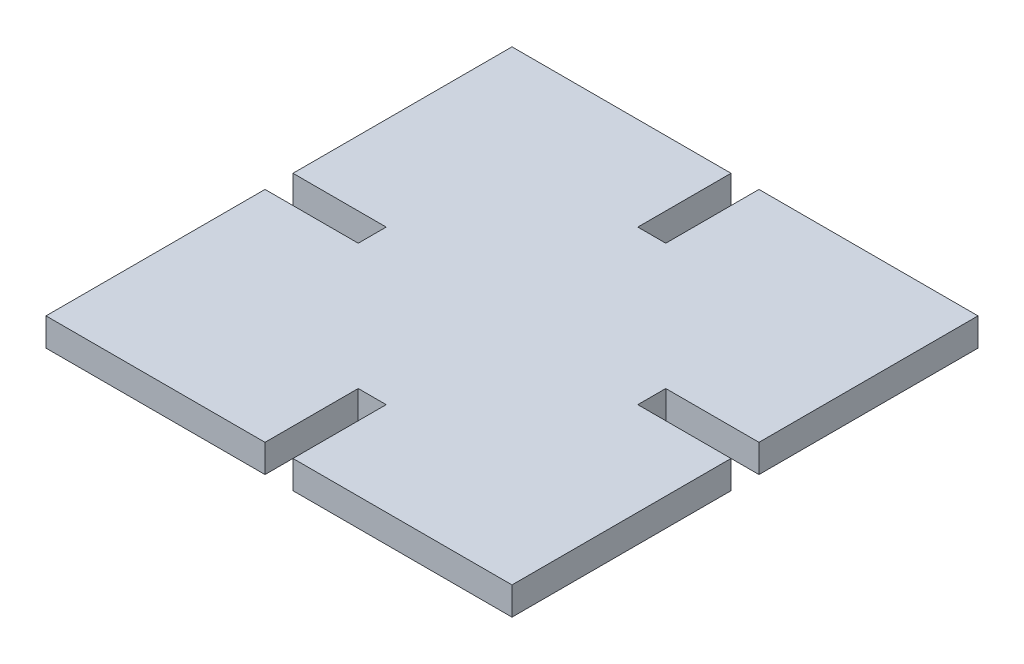
ISO-10303-21;
HEADER;
FILE_DESCRIPTION(('STEP AP214'),'2;1');
FILE_NAME('part.step','',(''),(''),'','','');
FILE_SCHEMA(('AUTOMOTIVE_DESIGN { 1 0 10303 214 1 1 1 1 }'));
ENDSEC;
DATA;
#1=APPLICATION_CONTEXT('core data for automotive mechanical design processes');
#2=APPLICATION_PROTOCOL_DEFINITION('international standard','automotive_design',2000,#1);
#3=PRODUCT_CONTEXT('',#1,'mechanical');
#4=PRODUCT('Part','Part','',(#3));
#5=PRODUCT_RELATED_PRODUCT_CATEGORY('part','',(#4));
#6=PRODUCT_DEFINITION_FORMATION('','',#4);
#7=PRODUCT_DEFINITION_CONTEXT('part definition',#1,'design');
#8=PRODUCT_DEFINITION('design','',#6,#7);
#9=PRODUCT_DEFINITION_SHAPE('','',#8);
#10=(LENGTH_UNIT() NAMED_UNIT(*) SI_UNIT(.MILLI.,.METRE.));
#11=(NAMED_UNIT(*) PLANE_ANGLE_UNIT() SI_UNIT($,.RADIAN.));
#12=(NAMED_UNIT(*) SI_UNIT($,.STERADIAN.) SOLID_ANGLE_UNIT());
#13=UNCERTAINTY_MEASURE_WITH_UNIT(LENGTH_MEASURE(1.E-05),#10,'distance_accuracy_value','');
#14=(GEOMETRIC_REPRESENTATION_CONTEXT(3) GLOBAL_UNCERTAINTY_ASSIGNED_CONTEXT((#13)) GLOBAL_UNIT_ASSIGNED_CONTEXT((#10,
#11,#12)) REPRESENTATION_CONTEXT('',''));
#15=CARTESIAN_POINT('',(0.,0.,0.));
#16=DIRECTION('',(0.,0.,1.));
#17=DIRECTION('',(1.,0.,0.));
#18=AXIS2_PLACEMENT_3D('',#15,#16,#17);
#19=CARTESIAN_POINT('',(-1.5,3.,-15.));
#20=DIRECTION('',(0.,0.,-1.));
#21=DIRECTION('',(-1.,0.,0.));
#22=AXIS2_PLACEMENT_3D('',#19,#20,#21);
#23=PLANE('',#22);
#24=DIRECTION('',(1.,0.,0.));
#25=VECTOR('',#24,1.);
#26=CARTESIAN_POINT('',(-1.5,0.,-15.));
#27=LINE('',#26,#25);
#28=CARTESIAN_POINT('',(-1.5,0.,-15.));
#29=VERTEX_POINT('',#28);
#30=CARTESIAN_POINT('',(1.5,0.,-15.));
#31=VERTEX_POINT('',#30);
#32=EDGE_CURVE('E198',#29,#31,#27,.T.);
#33=ORIENTED_EDGE('',*,*,#32,.F.);
#34=DIRECTION('',(0.,-1.,0.));
#35=VECTOR('',#34,1.);
#36=CARTESIAN_POINT('',(-1.5,3.,-15.));
#37=LINE('',#36,#35);
#38=CARTESIAN_POINT('',(-1.5,3.,-15.));
#39=VERTEX_POINT('',#38);
#40=EDGE_CURVE('E11',#39,#29,#37,.T.);
#41=ORIENTED_EDGE('',*,*,#40,.F.);
#42=DIRECTION('',(1.,0.,0.));
#43=VECTOR('',#42,1.);
#44=CARTESIAN_POINT('',(-1.5,3.,-15.));
#45=LINE('',#44,#43);
#46=CARTESIAN_POINT('',(1.5,3.,-15.));
#47=VERTEX_POINT('',#46);
#48=EDGE_CURVE('E246',#39,#47,#45,.T.);
#49=ORIENTED_EDGE('',*,*,#48,.T.);
#50=DIRECTION('',(0.,-1.,0.));
#51=VECTOR('',#50,1.);
#52=CARTESIAN_POINT('',(1.5,3.,-15.));
#53=LINE('',#52,#51);
#54=EDGE_CURVE('E35',#47,#31,#53,.T.);
#55=ORIENTED_EDGE('',*,*,#54,.T.);
#56=EDGE_LOOP('',(#33,#41,#49,#55));
#57=FACE_BOUND('',#56,.T.);
#58=ADVANCED_FACE('F32',(#57),#23,.T.);
#59=CARTESIAN_POINT('',(-1.5,3.,-25.));
#60=DIRECTION('',(1.,0.,0.));
#61=DIRECTION('',(0.,0.,-1.));
#62=AXIS2_PLACEMENT_3D('',#59,#60,#61);
#63=PLANE('',#62);
#64=DIRECTION('',(0.,0.,1.));
#65=VECTOR('',#64,1.);
#66=CARTESIAN_POINT('',(-1.5,0.,-25.));
#67=LINE('',#66,#65);
#68=CARTESIAN_POINT('',(-1.5,0.,-25.));
#69=VERTEX_POINT('',#68);
#70=EDGE_CURVE('E244',#69,#29,#67,.T.);
#71=ORIENTED_EDGE('',*,*,#70,.F.);
#72=DIRECTION('',(0.,-1.,0.));
#73=VECTOR('',#72,1.);
#74=CARTESIAN_POINT('',(-1.5,3.,-25.));
#75=LINE('',#74,#73);
#76=CARTESIAN_POINT('',(-1.5,3.,-25.));
#77=VERTEX_POINT('',#76);
#78=EDGE_CURVE('E41',#77,#69,#75,.T.);
#79=ORIENTED_EDGE('',*,*,#78,.F.);
#80=DIRECTION('',(0.,0.,1.));
#81=VECTOR('',#80,1.);
#82=CARTESIAN_POINT('',(-1.5,3.,-25.));
#83=LINE('',#82,#81);
#84=EDGE_CURVE('E193',#77,#39,#83,.T.);
#85=ORIENTED_EDGE('',*,*,#84,.T.);
#86=ORIENTED_EDGE('',*,*,#40,.T.);
#87=EDGE_LOOP('',(#71,#79,#85,#86));
#88=FACE_BOUND('',#87,.T.);
#89=ADVANCED_FACE('F290',(#88),#63,.T.);
#90=CARTESIAN_POINT('',(-25.,3.,-25.));
#91=DIRECTION('',(0.,0.,-1.));
#92=DIRECTION('',(-1.,0.,0.));
#93=AXIS2_PLACEMENT_3D('',#90,#91,#92);
#94=PLANE('',#93);
#95=DIRECTION('',(1.,0.,0.));
#96=VECTOR('',#95,1.);
#97=CARTESIAN_POINT('',(-25.,0.,-25.));
#98=LINE('',#97,#96);
#99=CARTESIAN_POINT('',(-25.,0.,-25.));
#100=VERTEX_POINT('',#99);
#101=EDGE_CURVE('E179',#100,#69,#98,.T.);
#102=ORIENTED_EDGE('',*,*,#101,.F.);
#103=DIRECTION('',(0.,-1.,0.));
#104=VECTOR('',#103,1.);
#105=CARTESIAN_POINT('',(-25.,3.,-25.));
#106=LINE('',#105,#104);
#107=CARTESIAN_POINT('',(-25.,3.,-25.));
#108=VERTEX_POINT('',#107);
#109=EDGE_CURVE('E173',#108,#100,#106,.T.);
#110=ORIENTED_EDGE('',*,*,#109,.F.);
#111=DIRECTION('',(1.,0.,0.));
#112=VECTOR('',#111,1.);
#113=CARTESIAN_POINT('',(-25.,3.,-25.));
#114=LINE('',#113,#112);
#115=EDGE_CURVE('E177',#108,#77,#114,.T.);
#116=ORIENTED_EDGE('',*,*,#115,.T.);
#117=ORIENTED_EDGE('',*,*,#78,.T.);
#118=EDGE_LOOP('',(#102,#110,#116,#117));
#119=FACE_BOUND('',#118,.T.);
#120=ADVANCED_FACE('F175',(#119),#94,.T.);
#121=CARTESIAN_POINT('',(-25.,3.,-25.));
#122=DIRECTION('',(1.,0.,0.));
#123=DIRECTION('',(0.,0.,-1.));
#124=AXIS2_PLACEMENT_3D('',#121,#122,#123);
#125=PLANE('',#124);
#126=DIRECTION('',(0.,0.,1.));
#127=VECTOR('',#126,1.);
#128=CARTESIAN_POINT('',(-25.,0.,-25.));
#129=LINE('',#128,#127);
#130=CARTESIAN_POINT('',(-25.,0.,-1.49999999999999));
#131=VERTEX_POINT('',#130);
#132=EDGE_CURVE('E241',#100,#131,#129,.T.);
#133=ORIENTED_EDGE('',*,*,#132,.T.);
#134=DIRECTION('',(0.,-1.,0.));
#135=VECTOR('',#134,1.);
#136=CARTESIAN_POINT('',(-25.,3.,-1.49999999999999));
#137=LINE('',#136,#135);
#138=CARTESIAN_POINT('',(-25.,3.,-1.49999999999999));
#139=VERTEX_POINT('',#138);
#140=EDGE_CURVE('E182',#139,#131,#137,.T.);
#141=ORIENTED_EDGE('',*,*,#140,.F.);
#142=DIRECTION('',(0.,0.,1.));
#143=VECTOR('',#142,1.);
#144=CARTESIAN_POINT('',(-25.,3.,-25.));
#145=LINE('',#144,#143);
#146=EDGE_CURVE('E185',#108,#139,#145,.T.);
#147=ORIENTED_EDGE('',*,*,#146,.F.);
#148=ORIENTED_EDGE('',*,*,#109,.T.);
#149=EDGE_LOOP('',(#133,#141,#147,#148));
#150=FACE_BOUND('',#149,.T.);
#151=ADVANCED_FACE('F186',(#150),#125,.F.);
#152=CARTESIAN_POINT('',(-25.,3.,-1.49999999999999));
#153=DIRECTION('',(0.,0.,-1.));
#154=DIRECTION('',(-1.,0.,0.));
#155=AXIS2_PLACEMENT_3D('',#152,#153,#154);
#156=PLANE('',#155);
#157=DIRECTION('',(1.,0.,0.));
#158=VECTOR('',#157,1.);
#159=CARTESIAN_POINT('',(-25.,0.,-1.49999999999999));
#160=LINE('',#159,#158);
#161=CARTESIAN_POINT('',(-15.,0.,-1.49999999999999));
#162=VERTEX_POINT('',#161);
#163=EDGE_CURVE('E239',#131,#162,#160,.T.);
#164=ORIENTED_EDGE('',*,*,#163,.T.);
#165=DIRECTION('',(0.,-1.,0.));
#166=VECTOR('',#165,1.);
#167=CARTESIAN_POINT('',(-15.,3.,-1.49999999999999));
#168=LINE('',#167,#166);
#169=CARTESIAN_POINT('',(-15.,3.,-1.49999999999999));
#170=VERTEX_POINT('',#169);
#171=EDGE_CURVE('E250',#170,#162,#168,.T.);
#172=ORIENTED_EDGE('',*,*,#171,.F.);
#173=DIRECTION('',(1.,0.,0.));
#174=VECTOR('',#173,1.);
#175=CARTESIAN_POINT('',(-25.,3.,-1.49999999999999));
#176=LINE('',#175,#174);
#177=EDGE_CURVE('E190',#139,#170,#176,.T.);
#178=ORIENTED_EDGE('',*,*,#177,.F.);
#179=ORIENTED_EDGE('',*,*,#140,.T.);
#180=EDGE_LOOP('',(#164,#172,#178,#179));
#181=FACE_BOUND('',#180,.T.);
#182=ADVANCED_FACE('F303',(#181),#156,.F.);
#183=CARTESIAN_POINT('',(-15.,3.,-1.49999999999999));
#184=DIRECTION('',(1.,0.,0.));
#185=DIRECTION('',(0.,0.,-1.));
#186=AXIS2_PLACEMENT_3D('',#183,#184,#185);
#187=PLANE('',#186);
#188=DIRECTION('',(0.,0.,1.));
#189=VECTOR('',#188,1.);
#190=CARTESIAN_POINT('',(-15.,0.,-1.49999999999999));
#191=LINE('',#190,#189);
#192=CARTESIAN_POINT('',(-15.,0.,1.49999999999999));
#193=VERTEX_POINT('',#192);
#194=EDGE_CURVE('E237',#162,#193,#191,.T.);
#195=ORIENTED_EDGE('',*,*,#194,.T.);
#196=DIRECTION('',(0.,-1.,0.));
#197=VECTOR('',#196,1.);
#198=CARTESIAN_POINT('',(-15.,3.,1.49999999999999));
#199=LINE('',#198,#197);
#200=CARTESIAN_POINT('',(-15.,3.,1.49999999999999));
#201=VERTEX_POINT('',#200);
#202=EDGE_CURVE('E253',#201,#193,#199,.T.);
#203=ORIENTED_EDGE('',*,*,#202,.F.);
#204=DIRECTION('',(0.,0.,1.));
#205=VECTOR('',#204,1.);
#206=CARTESIAN_POINT('',(-15.,3.,-1.49999999999999));
#207=LINE('',#206,#205);
#208=EDGE_CURVE('E548',#170,#201,#207,.T.);
#209=ORIENTED_EDGE('',*,*,#208,.F.);
#210=ORIENTED_EDGE('',*,*,#171,.T.);
#211=EDGE_LOOP('',(#195,#203,#209,#210));
#212=FACE_BOUND('',#211,.T.);
#213=ADVANCED_FACE('F306',(#212),#187,.F.);
#214=CARTESIAN_POINT('',(-15.,3.,1.49999999999999));
#215=DIRECTION('',(0.,0.,1.));
#216=DIRECTION('',(1.,0.,0.));
#217=AXIS2_PLACEMENT_3D('',#214,#215,#216);
#218=PLANE('',#217);
#219=DIRECTION('',(-1.,0.,0.));
#220=VECTOR('',#219,1.);
#221=CARTESIAN_POINT('',(-15.,0.,1.49999999999999));
#222=LINE('',#221,#220);
#223=CARTESIAN_POINT('',(-25.,0.,1.49999999999999));
#224=VERTEX_POINT('',#223);
#225=EDGE_CURVE('E235',#193,#224,#222,.T.);
#226=ORIENTED_EDGE('',*,*,#225,.T.);
#227=DIRECTION('',(0.,-1.,0.));
#228=VECTOR('',#227,1.);
#229=CARTESIAN_POINT('',(-25.,3.,1.49999999999999));
#230=LINE('',#229,#228);
#231=CARTESIAN_POINT('',(-25.,3.,1.49999999999999));
#232=VERTEX_POINT('',#231);
#233=EDGE_CURVE('E256',#232,#224,#230,.T.);
#234=ORIENTED_EDGE('',*,*,#233,.F.);
#235=DIRECTION('',(-1.,0.,0.));
#236=VECTOR('',#235,1.);
#237=CARTESIAN_POINT('',(-15.,3.,1.49999999999999));
#238=LINE('',#237,#236);
#239=EDGE_CURVE('E542',#201,#232,#238,.T.);
#240=ORIENTED_EDGE('',*,*,#239,.F.);
#241=ORIENTED_EDGE('',*,*,#202,.T.);
#242=EDGE_LOOP('',(#226,#234,#240,#241));
#243=FACE_BOUND('',#242,.T.);
#244=ADVANCED_FACE('F310',(#243),#218,.F.);
#245=CARTESIAN_POINT('',(-25.,3.,1.49999999999999));
#246=DIRECTION('',(1.,0.,0.));
#247=DIRECTION('',(0.,0.,-1.));
#248=AXIS2_PLACEMENT_3D('',#245,#246,#247);
#249=PLANE('',#248);
#250=DIRECTION('',(0.,0.,1.));
#251=VECTOR('',#250,1.);
#252=CARTESIAN_POINT('',(-25.,0.,1.49999999999999));
#253=LINE('',#252,#251);
#254=CARTESIAN_POINT('',(-25.,0.,25.));
#255=VERTEX_POINT('',#254);
#256=EDGE_CURVE('E233',#224,#255,#253,.T.);
#257=ORIENTED_EDGE('',*,*,#256,.T.);
#258=DIRECTION('',(0.,-1.,0.));
#259=VECTOR('',#258,1.);
#260=CARTESIAN_POINT('',(-25.,3.,25.));
#261=LINE('',#260,#259);
#262=CARTESIAN_POINT('',(-25.,3.,25.));
#263=VERTEX_POINT('',#262);
#264=EDGE_CURVE('E259',#263,#255,#261,.T.);
#265=ORIENTED_EDGE('',*,*,#264,.F.);
#266=DIRECTION('',(0.,0.,1.));
#267=VECTOR('',#266,1.);
#268=CARTESIAN_POINT('',(-25.,3.,1.49999999999999));
#269=LINE('',#268,#267);
#270=EDGE_CURVE('E539',#232,#263,#269,.T.);
#271=ORIENTED_EDGE('',*,*,#270,.F.);
#272=ORIENTED_EDGE('',*,*,#233,.T.);
#273=EDGE_LOOP('',(#257,#265,#271,#272));
#274=FACE_BOUND('',#273,.T.);
#275=ADVANCED_FACE('F314',(#274),#249,.F.);
#276=CARTESIAN_POINT('',(-25.,3.,25.));
#277=DIRECTION('',(0.,0.,-1.));
#278=DIRECTION('',(-1.,0.,0.));
#279=AXIS2_PLACEMENT_3D('',#276,#277,#278);
#280=PLANE('',#279);
#281=DIRECTION('',(1.,0.,0.));
#282=VECTOR('',#281,1.);
#283=CARTESIAN_POINT('',(-25.,0.,25.));
#284=LINE('',#283,#282);
#285=CARTESIAN_POINT('',(-1.5,0.,25.));
#286=VERTEX_POINT('',#285);
#287=EDGE_CURVE('E231',#255,#286,#284,.T.);
#288=ORIENTED_EDGE('',*,*,#287,.T.);
#289=DIRECTION('',(0.,-1.,0.));
#290=VECTOR('',#289,1.);
#291=CARTESIAN_POINT('',(-1.5,3.,25.));
#292=LINE('',#291,#290);
#293=CARTESIAN_POINT('',(-1.5,3.,25.));
#294=VERTEX_POINT('',#293);
#295=EDGE_CURVE('E262',#294,#286,#292,.T.);
#296=ORIENTED_EDGE('',*,*,#295,.F.);
#297=DIRECTION('',(1.,0.,0.));
#298=VECTOR('',#297,1.);
#299=CARTESIAN_POINT('',(-25.,3.,25.));
#300=LINE('',#299,#298);
#301=EDGE_CURVE('E537',#263,#294,#300,.T.);
#302=ORIENTED_EDGE('',*,*,#301,.F.);
#303=ORIENTED_EDGE('',*,*,#264,.T.);
#304=EDGE_LOOP('',(#288,#296,#302,#303));
#305=FACE_BOUND('',#304,.T.);
#306=ADVANCED_FACE('F318',(#305),#280,.F.);
#307=CARTESIAN_POINT('',(-1.5,3.,25.));
#308=DIRECTION('',(-1.,0.,0.));
#309=DIRECTION('',(0.,0.,1.));
#310=AXIS2_PLACEMENT_3D('',#307,#308,#309);
#311=PLANE('',#310);
#312=DIRECTION('',(0.,0.,-1.));
#313=VECTOR('',#312,1.);
#314=CARTESIAN_POINT('',(-1.5,0.,25.));
#315=LINE('',#314,#313);
#316=CARTESIAN_POINT('',(-1.5,0.,15.));
#317=VERTEX_POINT('',#316);
#318=EDGE_CURVE('E229',#286,#317,#315,.T.);
#319=ORIENTED_EDGE('',*,*,#318,.T.);
#320=DIRECTION('',(0.,-1.,0.));
#321=VECTOR('',#320,1.);
#322=CARTESIAN_POINT('',(-1.5,3.,15.));
#323=LINE('',#322,#321);
#324=CARTESIAN_POINT('',(-1.5,3.,15.));
#325=VERTEX_POINT('',#324);
#326=EDGE_CURVE('E265',#325,#317,#323,.T.);
#327=ORIENTED_EDGE('',*,*,#326,.F.);
#328=DIRECTION('',(0.,0.,-1.));
#329=VECTOR('',#328,1.);
#330=CARTESIAN_POINT('',(-1.5,3.,25.));
#331=LINE('',#330,#329);
#332=EDGE_CURVE('E530',#294,#325,#331,.T.);
#333=ORIENTED_EDGE('',*,*,#332,.F.);
#334=ORIENTED_EDGE('',*,*,#295,.T.);
#335=EDGE_LOOP('',(#319,#327,#333,#334));
#336=FACE_BOUND('',#335,.T.);
#337=ADVANCED_FACE('F322',(#336),#311,.F.);
#338=CARTESIAN_POINT('',(-1.5,3.,15.));
#339=DIRECTION('',(0.,0.,-1.));
#340=DIRECTION('',(-1.,0.,0.));
#341=AXIS2_PLACEMENT_3D('',#338,#339,#340);
#342=PLANE('',#341);
#343=DIRECTION('',(1.,0.,0.));
#344=VECTOR('',#343,1.);
#345=CARTESIAN_POINT('',(-1.5,0.,15.));
#346=LINE('',#345,#344);
#347=CARTESIAN_POINT('',(1.5,0.,15.));
#348=VERTEX_POINT('',#347);
#349=EDGE_CURVE('E227',#317,#348,#346,.T.);
#350=ORIENTED_EDGE('',*,*,#349,.T.);
#351=DIRECTION('',(0.,-1.,0.));
#352=VECTOR('',#351,1.);
#353=CARTESIAN_POINT('',(1.5,3.,15.));
#354=LINE('',#353,#352);
#355=CARTESIAN_POINT('',(1.5,3.,15.));
#356=VERTEX_POINT('',#355);
#357=EDGE_CURVE('E268',#356,#348,#354,.T.);
#358=ORIENTED_EDGE('',*,*,#357,.F.);
#359=DIRECTION('',(1.,0.,0.));
#360=VECTOR('',#359,1.);
#361=CARTESIAN_POINT('',(-1.5,3.,15.));
#362=LINE('',#361,#360);
#363=EDGE_CURVE('E527',#325,#356,#362,.T.);
#364=ORIENTED_EDGE('',*,*,#363,.F.);
#365=ORIENTED_EDGE('',*,*,#326,.T.);
#366=EDGE_LOOP('',(#350,#358,#364,#365));
#367=FACE_BOUND('',#366,.T.);
#368=ADVANCED_FACE('F326',(#367),#342,.F.);
#369=CARTESIAN_POINT('',(1.5,3.,15.));
#370=DIRECTION('',(1.,0.,0.));
#371=DIRECTION('',(0.,0.,-1.));
#372=AXIS2_PLACEMENT_3D('',#369,#370,#371);
#373=PLANE('',#372);
#374=DIRECTION('',(0.,0.,1.));
#375=VECTOR('',#374,1.);
#376=CARTESIAN_POINT('',(1.5,0.,15.));
#377=LINE('',#376,#375);
#378=CARTESIAN_POINT('',(1.5,0.,25.));
#379=VERTEX_POINT('',#378);
#380=EDGE_CURVE('E225',#348,#379,#377,.T.);
#381=ORIENTED_EDGE('',*,*,#380,.T.);
#382=DIRECTION('',(0.,-1.,0.));
#383=VECTOR('',#382,1.);
#384=CARTESIAN_POINT('',(1.5,3.,25.));
#385=LINE('',#384,#383);
#386=CARTESIAN_POINT('',(1.5,3.,25.));
#387=VERTEX_POINT('',#386);
#388=EDGE_CURVE('E271',#387,#379,#385,.T.);
#389=ORIENTED_EDGE('',*,*,#388,.F.);
#390=DIRECTION('',(0.,0.,1.));
#391=VECTOR('',#390,1.);
#392=CARTESIAN_POINT('',(1.5,3.,15.));
#393=LINE('',#392,#391);
#394=EDGE_CURVE('E525',#356,#387,#393,.T.);
#395=ORIENTED_EDGE('',*,*,#394,.F.);
#396=ORIENTED_EDGE('',*,*,#357,.T.);
#397=EDGE_LOOP('',(#381,#389,#395,#396));
#398=FACE_BOUND('',#397,.T.);
#399=ADVANCED_FACE('F330',(#398),#373,.F.);
#400=CARTESIAN_POINT('',(1.5,3.,25.));
#401=DIRECTION('',(0.,0.,-1.));
#402=DIRECTION('',(-1.,0.,0.));
#403=AXIS2_PLACEMENT_3D('',#400,#401,#402);
#404=PLANE('',#403);
#405=DIRECTION('',(1.,0.,0.));
#406=VECTOR('',#405,1.);
#407=CARTESIAN_POINT('',(1.5,0.,25.));
#408=LINE('',#407,#406);
#409=CARTESIAN_POINT('',(25.,0.,25.));
#410=VERTEX_POINT('',#409);
#411=EDGE_CURVE('E222',#379,#410,#408,.T.);
#412=ORIENTED_EDGE('',*,*,#411,.T.);
#413=DIRECTION('',(0.,-1.,0.));
#414=VECTOR('',#413,1.);
#415=CARTESIAN_POINT('',(25.,3.,25.));
#416=LINE('',#415,#414);
#417=CARTESIAN_POINT('',(25.,3.,25.));
#418=VERTEX_POINT('',#417);
#419=EDGE_CURVE('E274',#418,#410,#416,.T.);
#420=ORIENTED_EDGE('',*,*,#419,.F.);
#421=DIRECTION('',(1.,0.,0.));
#422=VECTOR('',#421,1.);
#423=CARTESIAN_POINT('',(1.5,3.,25.));
#424=LINE('',#423,#422);
#425=EDGE_CURVE('E557',#387,#418,#424,.T.);
#426=ORIENTED_EDGE('',*,*,#425,.F.);
#427=ORIENTED_EDGE('',*,*,#388,.T.);
#428=EDGE_LOOP('',(#412,#420,#426,#427));
#429=FACE_BOUND('',#428,.T.);
#430=ADVANCED_FACE('F334',(#429),#404,.F.);
#431=CARTESIAN_POINT('',(25.,3.,1.5));
#432=DIRECTION('',(1.,0.,0.));
#433=DIRECTION('',(0.,0.,-1.));
#434=AXIS2_PLACEMENT_3D('',#431,#432,#433);
#435=PLANE('',#434);
#436=DIRECTION('',(0.,0.,1.));
#437=VECTOR('',#436,1.);
#438=CARTESIAN_POINT('',(25.,0.,1.5));
#439=LINE('',#438,#437);
#440=CARTESIAN_POINT('',(25.,0.,1.5));
#441=VERTEX_POINT('',#440);
#442=EDGE_CURVE('E219',#441,#410,#439,.T.);
#443=ORIENTED_EDGE('',*,*,#442,.F.);
#444=DIRECTION('',(0.,-1.,0.));
#445=VECTOR('',#444,1.);
#446=CARTESIAN_POINT('',(25.,3.,1.5));
#447=LINE('',#446,#445);
#448=CARTESIAN_POINT('',(25.,3.,1.5));
#449=VERTEX_POINT('',#448);
#450=EDGE_CURVE('E276',#449,#441,#447,.T.);
#451=ORIENTED_EDGE('',*,*,#450,.F.);
#452=DIRECTION('',(0.,0.,1.));
#453=VECTOR('',#452,1.);
#454=CARTESIAN_POINT('',(25.,3.,1.5));
#455=LINE('',#454,#453);
#456=EDGE_CURVE('E517',#449,#418,#455,.T.);
#457=ORIENTED_EDGE('',*,*,#456,.T.);
#458=ORIENTED_EDGE('',*,*,#419,.T.);
#459=EDGE_LOOP('',(#443,#451,#457,#458));
#460=FACE_BOUND('',#459,.T.);
#461=ADVANCED_FACE('F338',(#460),#435,.T.);
#462=CARTESIAN_POINT('',(15.,3.,1.5));
#463=DIRECTION('',(0.,0.,-1.));
#464=DIRECTION('',(-1.,0.,0.));
#465=AXIS2_PLACEMENT_3D('',#462,#463,#464);
#466=PLANE('',#465);
#467=DIRECTION('',(1.,0.,0.));
#468=VECTOR('',#467,1.);
#469=CARTESIAN_POINT('',(15.,0.,1.5));
#470=LINE('',#469,#468);
#471=CARTESIAN_POINT('',(15.,0.,1.5));
#472=VERTEX_POINT('',#471);
#473=EDGE_CURVE('E216',#472,#441,#470,.T.);
#474=ORIENTED_EDGE('',*,*,#473,.F.);
#475=DIRECTION('',(0.,-1.,0.));
#476=VECTOR('',#475,1.);
#477=CARTESIAN_POINT('',(15.,3.,1.5));
#478=LINE('',#477,#476);
#479=CARTESIAN_POINT('',(15.,3.,1.5));
#480=VERTEX_POINT('',#479);
#481=EDGE_CURVE('E278',#480,#472,#478,.T.);
#482=ORIENTED_EDGE('',*,*,#481,.F.);
#483=DIRECTION('',(1.,0.,0.));
#484=VECTOR('',#483,1.);
#485=CARTESIAN_POINT('',(15.,3.,1.5));
#486=LINE('',#485,#484);
#487=EDGE_CURVE('E513',#480,#449,#486,.T.);
#488=ORIENTED_EDGE('',*,*,#487,.T.);
#489=ORIENTED_EDGE('',*,*,#450,.T.);
#490=EDGE_LOOP('',(#474,#482,#488,#489));
#491=FACE_BOUND('',#490,.T.);
#492=ADVANCED_FACE('F342',(#491),#466,.T.);
#493=CARTESIAN_POINT('',(15.,3.,-1.5));
#494=DIRECTION('',(1.,0.,0.));
#495=DIRECTION('',(0.,0.,-1.));
#496=AXIS2_PLACEMENT_3D('',#493,#494,#495);
#497=PLANE('',#496);
#498=DIRECTION('',(0.,0.,1.));
#499=VECTOR('',#498,1.);
#500=CARTESIAN_POINT('',(15.,0.,-1.5));
#501=LINE('',#500,#499);
#502=CARTESIAN_POINT('',(15.,0.,-1.5));
#503=VERTEX_POINT('',#502);
#504=EDGE_CURVE('E213',#503,#472,#501,.T.);
#505=ORIENTED_EDGE('',*,*,#504,.F.);
#506=DIRECTION('',(0.,-1.,0.));
#507=VECTOR('',#506,1.);
#508=CARTESIAN_POINT('',(15.,3.,-1.5));
#509=LINE('',#508,#507);
#510=CARTESIAN_POINT('',(15.,3.,-1.5));
#511=VERTEX_POINT('',#510);
#512=EDGE_CURVE('E280',#511,#503,#509,.T.);
#513=ORIENTED_EDGE('',*,*,#512,.F.);
#514=DIRECTION('',(0.,0.,1.));
#515=VECTOR('',#514,1.);
#516=CARTESIAN_POINT('',(15.,3.,-1.5));
#517=LINE('',#516,#515);
#518=EDGE_CURVE('E561',#511,#480,#517,.T.);
#519=ORIENTED_EDGE('',*,*,#518,.T.);
#520=ORIENTED_EDGE('',*,*,#481,.T.);
#521=EDGE_LOOP('',(#505,#513,#519,#520));
#522=FACE_BOUND('',#521,.T.);
#523=ADVANCED_FACE('F346',(#522),#497,.T.);
#524=CARTESIAN_POINT('',(25.,3.,-1.5));
#525=DIRECTION('',(0.,0.,1.));
#526=DIRECTION('',(1.,0.,0.));
#527=AXIS2_PLACEMENT_3D('',#524,#525,#526);
#528=PLANE('',#527);
#529=DIRECTION('',(-1.,0.,0.));
#530=VECTOR('',#529,1.);
#531=CARTESIAN_POINT('',(25.,0.,-1.5));
#532=LINE('',#531,#530);
#533=CARTESIAN_POINT('',(25.,0.,-1.5));
#534=VERTEX_POINT('',#533);
#535=EDGE_CURVE('E210',#534,#503,#532,.T.);
#536=ORIENTED_EDGE('',*,*,#535,.F.);
#537=DIRECTION('',(0.,-1.,0.));
#538=VECTOR('',#537,1.);
#539=CARTESIAN_POINT('',(25.,3.,-1.5));
#540=LINE('',#539,#538);
#541=CARTESIAN_POINT('',(25.,3.,-1.5));
#542=VERTEX_POINT('',#541);
#543=EDGE_CURVE('E282',#542,#534,#540,.T.);
#544=ORIENTED_EDGE('',*,*,#543,.F.);
#545=DIRECTION('',(-1.,0.,0.));
#546=VECTOR('',#545,1.);
#547=CARTESIAN_POINT('',(25.,3.,-1.5));
#548=LINE('',#547,#546);
#549=EDGE_CURVE('E505',#542,#511,#548,.T.);
#550=ORIENTED_EDGE('',*,*,#549,.T.);
#551=ORIENTED_EDGE('',*,*,#512,.T.);
#552=EDGE_LOOP('',(#536,#544,#550,#551));
#553=FACE_BOUND('',#552,.T.);
#554=ADVANCED_FACE('F350',(#553),#528,.T.);
#555=CARTESIAN_POINT('',(25.,3.,-25.));
#556=DIRECTION('',(1.,0.,0.));
#557=DIRECTION('',(0.,0.,-1.));
#558=AXIS2_PLACEMENT_3D('',#555,#556,#557);
#559=PLANE('',#558);
#560=DIRECTION('',(0.,0.,1.));
#561=VECTOR('',#560,1.);
#562=CARTESIAN_POINT('',(25.,0.,-25.));
#563=LINE('',#562,#561);
#564=CARTESIAN_POINT('',(25.,0.,-25.));
#565=VERTEX_POINT('',#564);
#566=EDGE_CURVE('E207',#565,#534,#563,.T.);
#567=ORIENTED_EDGE('',*,*,#566,.F.);
#568=DIRECTION('',(0.,-1.,0.));
#569=VECTOR('',#568,1.);
#570=CARTESIAN_POINT('',(25.,3.,-25.));
#571=LINE('',#570,#569);
#572=CARTESIAN_POINT('',(25.,3.,-25.));
#573=VERTEX_POINT('',#572);
#574=EDGE_CURVE('E284',#573,#565,#571,.T.);
#575=ORIENTED_EDGE('',*,*,#574,.F.);
#576=DIRECTION('',(0.,0.,1.));
#577=VECTOR('',#576,1.);
#578=CARTESIAN_POINT('',(25.,3.,-25.));
#579=LINE('',#578,#577);
#580=EDGE_CURVE('E501',#573,#542,#579,.T.);
#581=ORIENTED_EDGE('',*,*,#580,.T.);
#582=ORIENTED_EDGE('',*,*,#543,.T.);
#583=EDGE_LOOP('',(#567,#575,#581,#582));
#584=FACE_BOUND('',#583,.T.);
#585=ADVANCED_FACE('F354',(#584),#559,.T.);
#586=CARTESIAN_POINT('',(1.5,3.,-25.));
#587=DIRECTION('',(0.,0.,-1.));
#588=DIRECTION('',(-1.,0.,0.));
#589=AXIS2_PLACEMENT_3D('',#586,#587,#588);
#590=PLANE('',#589);
#591=DIRECTION('',(1.,0.,0.));
#592=VECTOR('',#591,1.);
#593=CARTESIAN_POINT('',(1.5,0.,-25.));
#594=LINE('',#593,#592);
#595=CARTESIAN_POINT('',(1.5,0.,-25.));
#596=VERTEX_POINT('',#595);
#597=EDGE_CURVE('E204',#596,#565,#594,.T.);
#598=ORIENTED_EDGE('',*,*,#597,.F.);
#599=DIRECTION('',(0.,-1.,0.));
#600=VECTOR('',#599,1.);
#601=CARTESIAN_POINT('',(1.5,3.,-25.));
#602=LINE('',#601,#600);
#603=CARTESIAN_POINT('',(1.5,3.,-25.));
#604=VERTEX_POINT('',#603);
#605=EDGE_CURVE('E285',#604,#596,#602,.T.);
#606=ORIENTED_EDGE('',*,*,#605,.F.);
#607=DIRECTION('',(1.,0.,0.));
#608=VECTOR('',#607,1.);
#609=CARTESIAN_POINT('',(1.5,3.,-25.));
#610=LINE('',#609,#608);
#611=EDGE_CURVE('E565',#604,#573,#610,.T.);
#612=ORIENTED_EDGE('',*,*,#611,.T.);
#613=ORIENTED_EDGE('',*,*,#574,.T.);
#614=EDGE_LOOP('',(#598,#606,#612,#613));
#615=FACE_BOUND('',#614,.T.);
#616=ADVANCED_FACE('F358',(#615),#590,.T.);
#617=CARTESIAN_POINT('',(1.5,3.,-15.));
#618=DIRECTION('',(-1.,0.,0.));
#619=DIRECTION('',(0.,0.,1.));
#620=AXIS2_PLACEMENT_3D('',#617,#618,#619);
#621=PLANE('',#620);
#622=DIRECTION('',(0.,0.,-1.));
#623=VECTOR('',#622,1.);
#624=CARTESIAN_POINT('',(1.5,0.,-15.));
#625=LINE('',#624,#623);
#626=EDGE_CURVE('E201',#31,#596,#625,.T.);
#627=ORIENTED_EDGE('',*,*,#626,.F.);
#628=ORIENTED_EDGE('',*,*,#54,.F.);
#629=DIRECTION('',(0.,0.,-1.));
#630=VECTOR('',#629,1.);
#631=CARTESIAN_POINT('',(1.5,3.,-15.));
#632=LINE('',#631,#630);
#633=EDGE_CURVE('E567',#47,#604,#632,.T.);
#634=ORIENTED_EDGE('',*,*,#633,.T.);
#635=ORIENTED_EDGE('',*,*,#605,.T.);
#636=EDGE_LOOP('',(#627,#628,#634,#635));
#637=FACE_BOUND('',#636,.T.);
#638=ADVANCED_FACE('F287',(#637),#621,.T.);
#639=CARTESIAN_POINT('',(0.,3.,0.));
#640=DIRECTION('',(0.,1.,0.));
#641=DIRECTION('',(0.,0.,1.));
#642=AXIS2_PLACEMENT_3D('',#639,#640,#641);
#643=PLANE('',#642);
#644=ORIENTED_EDGE('',*,*,#48,.F.);
#645=ORIENTED_EDGE('',*,*,#84,.F.);
#646=ORIENTED_EDGE('',*,*,#115,.F.);
#647=ORIENTED_EDGE('',*,*,#146,.T.);
#648=ORIENTED_EDGE('',*,*,#177,.T.);
#649=ORIENTED_EDGE('',*,*,#208,.T.);
#650=ORIENTED_EDGE('',*,*,#239,.T.);
#651=ORIENTED_EDGE('',*,*,#270,.T.);
#652=ORIENTED_EDGE('',*,*,#301,.T.);
#653=ORIENTED_EDGE('',*,*,#332,.T.);
#654=ORIENTED_EDGE('',*,*,#363,.T.);
#655=ORIENTED_EDGE('',*,*,#394,.T.);
#656=ORIENTED_EDGE('',*,*,#425,.T.);
#657=ORIENTED_EDGE('',*,*,#456,.F.);
#658=ORIENTED_EDGE('',*,*,#487,.F.);
#659=ORIENTED_EDGE('',*,*,#518,.F.);
#660=ORIENTED_EDGE('',*,*,#549,.F.);
#661=ORIENTED_EDGE('',*,*,#580,.F.);
#662=ORIENTED_EDGE('',*,*,#611,.F.);
#663=ORIENTED_EDGE('',*,*,#633,.F.);
#664=EDGE_LOOP('',(#644,#645,#646,#647,#648,#649,#650,#651,#652,#653,#654,#655,#656,#657,#658,
#659,#660,#661,#662,#663));
#665=FACE_BOUND('',#664,.T.);
#666=ADVANCED_FACE('F192',(#665),#643,.T.);
#667=CARTESIAN_POINT('',(0.,0.,0.));
#668=DIRECTION('',(0.,1.,0.));
#669=DIRECTION('',(0.,0.,1.));
#670=AXIS2_PLACEMENT_3D('',#667,#668,#669);
#671=PLANE('',#670);
#672=ORIENTED_EDGE('',*,*,#32,.T.);
#673=ORIENTED_EDGE('',*,*,#626,.T.);
#674=ORIENTED_EDGE('',*,*,#597,.T.);
#675=ORIENTED_EDGE('',*,*,#566,.T.);
#676=ORIENTED_EDGE('',*,*,#535,.T.);
#677=ORIENTED_EDGE('',*,*,#504,.T.);
#678=ORIENTED_EDGE('',*,*,#473,.T.);
#679=ORIENTED_EDGE('',*,*,#442,.T.);
#680=ORIENTED_EDGE('',*,*,#411,.F.);
#681=ORIENTED_EDGE('',*,*,#380,.F.);
#682=ORIENTED_EDGE('',*,*,#349,.F.);
#683=ORIENTED_EDGE('',*,*,#318,.F.);
#684=ORIENTED_EDGE('',*,*,#287,.F.);
#685=ORIENTED_EDGE('',*,*,#256,.F.);
#686=ORIENTED_EDGE('',*,*,#225,.F.);
#687=ORIENTED_EDGE('',*,*,#194,.F.);
#688=ORIENTED_EDGE('',*,*,#163,.F.);
#689=ORIENTED_EDGE('',*,*,#132,.F.);
#690=ORIENTED_EDGE('',*,*,#101,.T.);
#691=ORIENTED_EDGE('',*,*,#70,.T.);
#692=EDGE_LOOP('',(#672,#673,#674,#675,#676,#677,#678,#679,#680,#681,#682,#683,#684,#685,#686,
#687,#688,#689,#690,#691));
#693=FACE_BOUND('',#692,.T.);
#694=ADVANCED_FACE('F289',(#693),#671,.F.);
#695=CLOSED_SHELL('',(#58,#89,#120,#151,#182,#213,#244,#275,#306,#337,#368,#399,#430,#461,#492,
#523,#554,#585,#616,#638,#666,#694));
#696=MANIFOLD_SOLID_BREP('B2',#695);
#697=ADVANCED_BREP_SHAPE_REPRESENTATION('',(#18,#696),#14);
#698=SHAPE_DEFINITION_REPRESENTATION(#9,#697);
ENDSEC;
END-ISO-10303-21;
